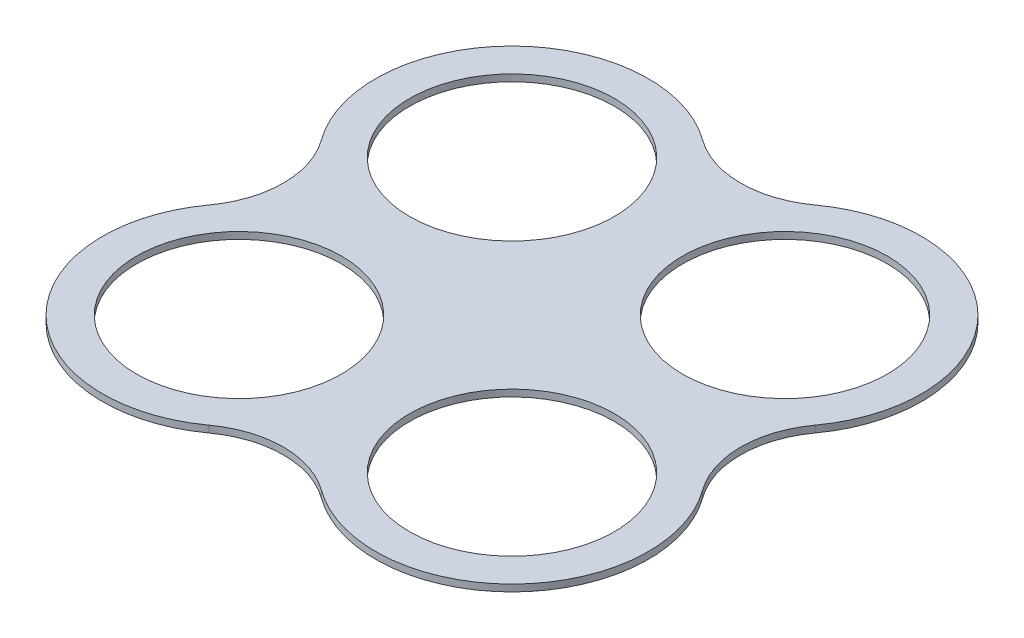
ISO-10303-21;
HEADER;
FILE_DESCRIPTION(('STEP AP214'),'2;1');
FILE_NAME('part.step','',(''),(''),'','','');
FILE_SCHEMA(('AUTOMOTIVE_DESIGN { 1 0 10303 214 1 1 1 1 }'));
ENDSEC;
DATA;
#1=APPLICATION_CONTEXT('core data for automotive mechanical design processes');
#2=APPLICATION_PROTOCOL_DEFINITION('international standard','automotive_design',2000,#1);
#3=PRODUCT_CONTEXT('',#1,'mechanical');
#4=PRODUCT('Part','Part','',(#3));
#5=PRODUCT_RELATED_PRODUCT_CATEGORY('part','',(#4));
#6=PRODUCT_DEFINITION_FORMATION('','',#4);
#7=PRODUCT_DEFINITION_CONTEXT('part definition',#1,'design');
#8=PRODUCT_DEFINITION('design','',#6,#7);
#9=PRODUCT_DEFINITION_SHAPE('','',#8);
#10=(LENGTH_UNIT() NAMED_UNIT(*) SI_UNIT(.MILLI.,.METRE.));
#11=(NAMED_UNIT(*) PLANE_ANGLE_UNIT() SI_UNIT($,.RADIAN.));
#12=(NAMED_UNIT(*) SI_UNIT($,.STERADIAN.) SOLID_ANGLE_UNIT());
#13=UNCERTAINTY_MEASURE_WITH_UNIT(LENGTH_MEASURE(1.E-05),#10,'distance_accuracy_value','');
#14=(GEOMETRIC_REPRESENTATION_CONTEXT(3) GLOBAL_UNCERTAINTY_ASSIGNED_CONTEXT((#13)) GLOBAL_UNIT_ASSIGNED_CONTEXT((#10,
#11,#12)) REPRESENTATION_CONTEXT('',''));
#15=CARTESIAN_POINT('',(0.,0.,0.));
#16=DIRECTION('',(0.,0.,1.));
#17=DIRECTION('',(1.,0.,0.));
#18=AXIS2_PLACEMENT_3D('',#15,#16,#17);
#19=CARTESIAN_POINT('',(190.5,6.35,-87.2980669889087));
#20=DIRECTION('',(0.,1.,0.));
#21=DIRECTION('',(0.,0.,1.));
#22=AXIS2_PLACEMENT_3D('',#19,#20,#21);
#23=PLANE('',#22);
#24=CARTESIAN_POINT('',(254.,6.35,254.));
#25=DIRECTION('',(0.,1.,0.));
#26=DIRECTION('',(0.,0.,1.));
#27=AXIS2_PLACEMENT_3D('',#24,#25,#26);
#28=CIRCLE('',#27,95.25);
#29=CARTESIAN_POINT('',(254.,6.35,349.25));
#30=VERTEX_POINT('',#29);
#31=EDGE_CURVE('E187',#30,#30,#28,.T.);
#32=ORIENTED_EDGE('',*,*,#31,.F.);
#33=EDGE_LOOP('',(#32));
#34=FACE_BOUND('',#33,.T.);
#35=CARTESIAN_POINT('',(0.,6.35,0.));
#36=DIRECTION('',(0.,1.,0.));
#37=DIRECTION('',(0.,0.,1.));
#38=AXIS2_PLACEMENT_3D('',#35,#36,#37);
#39=CIRCLE('',#38,95.25);
#40=CARTESIAN_POINT('',(0.,6.35,95.25));
#41=VERTEX_POINT('',#40);
#42=EDGE_CURVE('E133',#41,#41,#39,.T.);
#43=ORIENTED_EDGE('',*,*,#42,.F.);
#44=EDGE_LOOP('',(#43));
#45=FACE_BOUND('',#44,.T.);
#46=CARTESIAN_POINT('',(127.,6.35,-174.596133977817));
#47=DIRECTION('',(0.,-1.,0.));
#48=DIRECTION('',(0.,0.,1.));
#49=AXIS2_PLACEMENT_3D('',#46,#47,#48);
#50=CIRCLE('',#49,88.8999999999999);
#51=CARTESIAN_POINT('',(179.294117647059,6.35,-102.703608222245));
#52=VERTEX_POINT('',#51);
#53=CARTESIAN_POINT('',(74.7058823529412,6.35,-102.703608222246));
#54=VERTEX_POINT('',#53);
#55=EDGE_CURVE('E144',#52,#54,#50,.T.);
#56=ORIENTED_EDGE('',*,*,#55,.T.);
#57=CARTESIAN_POINT('',(0.,6.35,0.));
#58=DIRECTION('',(0.,1.,0.));
#59=DIRECTION('',(0.,0.,1.));
#60=AXIS2_PLACEMENT_3D('',#57,#58,#59);
#61=CIRCLE('',#60,127.);
#62=CARTESIAN_POINT('',(-102.703608222246,6.35,74.7058823529412));
#63=VERTEX_POINT('',#62);
#64=EDGE_CURVE('E92',#54,#63,#61,.T.);
#65=ORIENTED_EDGE('',*,*,#64,.T.);
#66=CARTESIAN_POINT('',(-174.596133977818,6.35,127.));
#67=DIRECTION('',(0.,-1.,0.));
#68=DIRECTION('',(0.,0.,1.));
#69=AXIS2_PLACEMENT_3D('',#66,#67,#68);
#70=CIRCLE('',#69,88.9);
#71=CARTESIAN_POINT('',(-102.703608222246,6.35,179.294117647059));
#72=VERTEX_POINT('',#71);
#73=EDGE_CURVE('E159',#63,#72,#70,.T.);
#74=ORIENTED_EDGE('',*,*,#73,.T.);
#75=CARTESIAN_POINT('',(0.,6.35,254.));
#76=DIRECTION('',(0.,1.,0.));
#77=DIRECTION('',(0.,0.,1.));
#78=AXIS2_PLACEMENT_3D('',#75,#76,#77);
#79=CIRCLE('',#78,127.);
#80=CARTESIAN_POINT('',(74.7058823529411,6.35,356.703608222246));
#81=VERTEX_POINT('',#80);
#82=EDGE_CURVE('E172',#72,#81,#79,.T.);
#83=ORIENTED_EDGE('',*,*,#82,.T.);
#84=CARTESIAN_POINT('',(127.,6.35,428.596133977818));
#85=DIRECTION('',(0.,-1.,0.));
#86=DIRECTION('',(0.,0.,1.));
#87=AXIS2_PLACEMENT_3D('',#84,#85,#86);
#88=CIRCLE('',#87,88.9000000000001);
#89=CARTESIAN_POINT('',(179.294117647059,6.35,356.703608222246));
#90=VERTEX_POINT('',#89);
#91=EDGE_CURVE('E111',#81,#90,#88,.T.);
#92=ORIENTED_EDGE('',*,*,#91,.T.);
#93=CARTESIAN_POINT('',(254.,6.35,254.));
#94=DIRECTION('',(0.,1.,0.));
#95=DIRECTION('',(0.,0.,1.));
#96=AXIS2_PLACEMENT_3D('',#93,#94,#95);
#97=CIRCLE('',#96,127.);
#98=CARTESIAN_POINT('',(356.703608222246,6.35,179.294117647059));
#99=VERTEX_POINT('',#98);
#100=EDGE_CURVE('E105',#90,#99,#97,.T.);
#101=ORIENTED_EDGE('',*,*,#100,.T.);
#102=CARTESIAN_POINT('',(428.596133977817,6.35,127.));
#103=DIRECTION('',(0.,-1.,0.));
#104=DIRECTION('',(0.,0.,1.));
#105=AXIS2_PLACEMENT_3D('',#102,#103,#104);
#106=CIRCLE('',#105,88.8999999999999);
#107=CARTESIAN_POINT('',(356.703608222246,6.35,74.7058823529412));
#108=VERTEX_POINT('',#107);
#109=EDGE_CURVE('E109',#99,#108,#106,.T.);
#110=ORIENTED_EDGE('',*,*,#109,.T.);
#111=CARTESIAN_POINT('',(254.,6.35,0.));
#112=DIRECTION('',(0.,1.,0.));
#113=DIRECTION('',(0.,0.,1.));
#114=AXIS2_PLACEMENT_3D('',#111,#112,#113);
#115=CIRCLE('',#114,127.);
#116=EDGE_CURVE('E49',#108,#52,#115,.T.);
#117=ORIENTED_EDGE('',*,*,#116,.T.);
#118=EDGE_LOOP('',(#56,#65,#74,#83,#92,#101,#110,#117));
#119=FACE_BOUND('',#118,.T.);
#120=CARTESIAN_POINT('',(254.,6.35,0.));
#121=DIRECTION('',(0.,1.,0.));
#122=DIRECTION('',(0.,0.,1.));
#123=AXIS2_PLACEMENT_3D('',#120,#121,#122);
#124=CIRCLE('',#123,95.25);
#125=CARTESIAN_POINT('',(254.,6.35,95.2500000000001));
#126=VERTEX_POINT('',#125);
#127=EDGE_CURVE('E181',#126,#126,#124,.T.);
#128=ORIENTED_EDGE('',*,*,#127,.F.);
#129=EDGE_LOOP('',(#128));
#130=FACE_BOUND('',#129,.T.);
#131=CARTESIAN_POINT('',(0.,6.35,254.));
#132=DIRECTION('',(0.,1.,0.));
#133=DIRECTION('',(0.,0.,1.));
#134=AXIS2_PLACEMENT_3D('',#131,#132,#133);
#135=CIRCLE('',#134,95.25);
#136=CARTESIAN_POINT('',(0.,6.35,349.25));
#137=VERTEX_POINT('',#136);
#138=EDGE_CURVE('E193',#137,#137,#135,.T.);
#139=ORIENTED_EDGE('',*,*,#138,.F.);
#140=EDGE_LOOP('',(#139));
#141=FACE_BOUND('',#140,.T.);
#142=ADVANCED_FACE('F32',(#34,#45,#119,#130,#141),#23,.T.);
#143=CARTESIAN_POINT('',(190.5,0.,-87.2980669889087));
#144=DIRECTION('',(0.,1.,0.));
#145=DIRECTION('',(0.,0.,1.));
#146=AXIS2_PLACEMENT_3D('',#143,#144,#145);
#147=PLANE('',#146);
#148=CARTESIAN_POINT('',(127.,0.,-174.596133977817));
#149=DIRECTION('',(0.,-1.,0.));
#150=DIRECTION('',(0.,0.,1.));
#151=AXIS2_PLACEMENT_3D('',#148,#149,#150);
#152=CIRCLE('',#151,88.8999999999999);
#153=CARTESIAN_POINT('',(179.294117647059,0.,-102.703608222245));
#154=VERTEX_POINT('',#153);
#155=CARTESIAN_POINT('',(74.7058823529412,0.,-102.703608222246));
#156=VERTEX_POINT('',#155);
#157=EDGE_CURVE('E129',#154,#156,#152,.T.);
#158=ORIENTED_EDGE('',*,*,#157,.F.);
#159=CARTESIAN_POINT('',(254.,0.,0.));
#160=DIRECTION('',(0.,1.,0.));
#161=DIRECTION('',(0.,0.,1.));
#162=AXIS2_PLACEMENT_3D('',#159,#160,#161);
#163=CIRCLE('',#162,127.);
#164=CARTESIAN_POINT('',(356.703608222246,0.,74.7058823529412));
#165=VERTEX_POINT('',#164);
#166=EDGE_CURVE('E84',#165,#154,#163,.T.);
#167=ORIENTED_EDGE('',*,*,#166,.F.);
#168=CARTESIAN_POINT('',(428.596133977817,0.,127.));
#169=DIRECTION('',(0.,-1.,0.));
#170=DIRECTION('',(0.,0.,1.));
#171=AXIS2_PLACEMENT_3D('',#168,#169,#170);
#172=CIRCLE('',#171,88.8999999999999);
#173=CARTESIAN_POINT('',(356.703608222246,0.,179.294117647059));
#174=VERTEX_POINT('',#173);
#175=EDGE_CURVE('E78',#174,#165,#172,.T.);
#176=ORIENTED_EDGE('',*,*,#175,.F.);
#177=CARTESIAN_POINT('',(254.,0.,254.));
#178=DIRECTION('',(0.,1.,0.));
#179=DIRECTION('',(0.,0.,1.));
#180=AXIS2_PLACEMENT_3D('',#177,#178,#179);
#181=CIRCLE('',#180,127.);
#182=CARTESIAN_POINT('',(179.294117647059,0.,356.703608222246));
#183=VERTEX_POINT('',#182);
#184=EDGE_CURVE('E119',#183,#174,#181,.T.);
#185=ORIENTED_EDGE('',*,*,#184,.F.);
#186=CARTESIAN_POINT('',(127.,0.,428.596133977818));
#187=DIRECTION('',(0.,-1.,0.));
#188=DIRECTION('',(0.,0.,1.));
#189=AXIS2_PLACEMENT_3D('',#186,#187,#188);
#190=CIRCLE('',#189,88.9000000000001);
#191=CARTESIAN_POINT('',(74.7058823529411,0.,356.703608222246));
#192=VERTEX_POINT('',#191);
#193=EDGE_CURVE('E139',#192,#183,#190,.T.);
#194=ORIENTED_EDGE('',*,*,#193,.F.);
#195=CARTESIAN_POINT('',(0.,0.,254.));
#196=DIRECTION('',(0.,1.,0.));
#197=DIRECTION('',(0.,0.,1.));
#198=AXIS2_PLACEMENT_3D('',#195,#196,#197);
#199=CIRCLE('',#198,127.);
#200=CARTESIAN_POINT('',(-102.703608222246,0.,179.294117647059));
#201=VERTEX_POINT('',#200);
#202=EDGE_CURVE('E137',#201,#192,#199,.T.);
#203=ORIENTED_EDGE('',*,*,#202,.F.);
#204=CARTESIAN_POINT('',(-174.596133977818,0.,127.));
#205=DIRECTION('',(0.,-1.,0.));
#206=DIRECTION('',(0.,0.,1.));
#207=AXIS2_PLACEMENT_3D('',#204,#205,#206);
#208=CIRCLE('',#207,88.9);
#209=CARTESIAN_POINT('',(-102.703608222246,0.,74.7058823529412));
#210=VERTEX_POINT('',#209);
#211=EDGE_CURVE('E135',#210,#201,#208,.T.);
#212=ORIENTED_EDGE('',*,*,#211,.F.);
#213=CARTESIAN_POINT('',(0.,0.,0.));
#214=DIRECTION('',(0.,1.,0.));
#215=DIRECTION('',(0.,0.,1.));
#216=AXIS2_PLACEMENT_3D('',#213,#214,#215);
#217=CIRCLE('',#216,127.);
#218=EDGE_CURVE('E132',#156,#210,#217,.T.);
#219=ORIENTED_EDGE('',*,*,#218,.F.);
#220=EDGE_LOOP('',(#158,#167,#176,#185,#194,#203,#212,#219));
#221=FACE_BOUND('',#220,.T.);
#222=CARTESIAN_POINT('',(0.,0.,0.));
#223=DIRECTION('',(0.,1.,0.));
#224=DIRECTION('',(0.,0.,1.));
#225=AXIS2_PLACEMENT_3D('',#222,#223,#224);
#226=CIRCLE('',#225,95.25);
#227=CARTESIAN_POINT('',(0.,0.,95.25));
#228=VERTEX_POINT('',#227);
#229=EDGE_CURVE('E178',#228,#228,#226,.T.);
#230=ORIENTED_EDGE('',*,*,#229,.T.);
#231=EDGE_LOOP('',(#230));
#232=FACE_BOUND('',#231,.T.);
#233=CARTESIAN_POINT('',(254.,0.,0.));
#234=DIRECTION('',(0.,1.,0.));
#235=DIRECTION('',(0.,0.,1.));
#236=AXIS2_PLACEMENT_3D('',#233,#234,#235);
#237=CIRCLE('',#236,95.25);
#238=CARTESIAN_POINT('',(254.,0.,95.2500000000001));
#239=VERTEX_POINT('',#238);
#240=EDGE_CURVE('E184',#239,#239,#237,.T.);
#241=ORIENTED_EDGE('',*,*,#240,.T.);
#242=EDGE_LOOP('',(#241));
#243=FACE_BOUND('',#242,.T.);
#244=CARTESIAN_POINT('',(254.,0.,254.));
#245=DIRECTION('',(0.,1.,0.));
#246=DIRECTION('',(0.,0.,1.));
#247=AXIS2_PLACEMENT_3D('',#244,#245,#246);
#248=CIRCLE('',#247,95.25);
#249=CARTESIAN_POINT('',(254.,0.,349.25));
#250=VERTEX_POINT('',#249);
#251=EDGE_CURVE('E190',#250,#250,#248,.T.);
#252=ORIENTED_EDGE('',*,*,#251,.T.);
#253=EDGE_LOOP('',(#252));
#254=FACE_BOUND('',#253,.T.);
#255=CARTESIAN_POINT('',(0.,0.,254.));
#256=DIRECTION('',(0.,1.,0.));
#257=DIRECTION('',(0.,0.,1.));
#258=AXIS2_PLACEMENT_3D('',#255,#256,#257);
#259=CIRCLE('',#258,95.25);
#260=CARTESIAN_POINT('',(0.,0.,349.25));
#261=VERTEX_POINT('',#260);
#262=EDGE_CURVE('E196',#261,#261,#259,.T.);
#263=ORIENTED_EDGE('',*,*,#262,.T.);
#264=EDGE_LOOP('',(#263));
#265=FACE_BOUND('',#264,.T.);
#266=ADVANCED_FACE('F163',(#221,#232,#243,#254,#265),#147,.F.);
#267=CARTESIAN_POINT('',(127.,6.35,-174.596133977817));
#268=DIRECTION('',(0.,-1.,0.));
#269=DIRECTION('',(0.,0.,-1.));
#270=AXIS2_PLACEMENT_3D('',#267,#268,#269);
#271=CYLINDRICAL_SURFACE('',#270,88.8999999999999);
#272=ORIENTED_EDGE('',*,*,#157,.T.);
#273=DIRECTION('',(0.,-1.,0.));
#274=VECTOR('',#273,1.);
#275=CARTESIAN_POINT('',(74.7058823529412,6.35,-102.703608222246));
#276=LINE('',#275,#274);
#277=EDGE_CURVE('E11',#54,#156,#276,.T.);
#278=ORIENTED_EDGE('',*,*,#277,.F.);
#279=ORIENTED_EDGE('',*,*,#55,.F.);
#280=DIRECTION('',(0.,-1.,0.));
#281=VECTOR('',#280,1.);
#282=CARTESIAN_POINT('',(179.294117647059,6.35,-102.703608222245));
#283=LINE('',#282,#281);
#284=EDGE_CURVE('E125',#52,#154,#283,.T.);
#285=ORIENTED_EDGE('',*,*,#284,.T.);
#286=EDGE_LOOP('',(#272,#278,#279,#285));
#287=FACE_BOUND('',#286,.T.);
#288=ADVANCED_FACE('F34',(#287),#271,.F.);
#289=CARTESIAN_POINT('',(0.,6.35,0.));
#290=DIRECTION('',(0.,-1.,0.));
#291=DIRECTION('',(0.,0.,-1.));
#292=AXIS2_PLACEMENT_3D('',#289,#290,#291);
#293=CYLINDRICAL_SURFACE('',#292,127.);
#294=ORIENTED_EDGE('',*,*,#218,.T.);
#295=DIRECTION('',(0.,-1.,0.));
#296=VECTOR('',#295,1.);
#297=CARTESIAN_POINT('',(-102.703608222246,6.35,74.7058823529412));
#298=LINE('',#297,#296);
#299=EDGE_CURVE('E41',#63,#210,#298,.T.);
#300=ORIENTED_EDGE('',*,*,#299,.F.);
#301=ORIENTED_EDGE('',*,*,#64,.F.);
#302=ORIENTED_EDGE('',*,*,#277,.T.);
#303=EDGE_LOOP('',(#294,#300,#301,#302));
#304=FACE_BOUND('',#303,.T.);
#305=ADVANCED_FACE('F230',(#304),#293,.T.);
#306=CARTESIAN_POINT('',(-174.596133977818,6.35,127.));
#307=DIRECTION('',(0.,-1.,0.));
#308=DIRECTION('',(0.,0.,-1.));
#309=AXIS2_PLACEMENT_3D('',#306,#307,#308);
#310=CYLINDRICAL_SURFACE('',#309,88.9);
#311=ORIENTED_EDGE('',*,*,#211,.T.);
#312=DIRECTION('',(0.,-1.,0.));
#313=VECTOR('',#312,1.);
#314=CARTESIAN_POINT('',(-102.703608222246,6.35,179.294117647059));
#315=LINE('',#314,#313);
#316=EDGE_CURVE('E151',#72,#201,#315,.T.);
#317=ORIENTED_EDGE('',*,*,#316,.F.);
#318=ORIENTED_EDGE('',*,*,#73,.F.);
#319=ORIENTED_EDGE('',*,*,#299,.T.);
#320=EDGE_LOOP('',(#311,#317,#318,#319));
#321=FACE_BOUND('',#320,.T.);
#322=ADVANCED_FACE('F157',(#321),#310,.F.);
#323=CARTESIAN_POINT('',(0.,6.35,254.));
#324=DIRECTION('',(0.,-1.,0.));
#325=DIRECTION('',(0.,0.,-1.));
#326=AXIS2_PLACEMENT_3D('',#323,#324,#325);
#327=CYLINDRICAL_SURFACE('',#326,127.);
#328=ORIENTED_EDGE('',*,*,#202,.T.);
#329=DIRECTION('',(0.,-1.,0.));
#330=VECTOR('',#329,1.);
#331=CARTESIAN_POINT('',(74.7058823529411,6.35,356.703608222246));
#332=LINE('',#331,#330);
#333=EDGE_CURVE('E148',#81,#192,#332,.T.);
#334=ORIENTED_EDGE('',*,*,#333,.F.);
#335=ORIENTED_EDGE('',*,*,#82,.F.);
#336=ORIENTED_EDGE('',*,*,#316,.T.);
#337=EDGE_LOOP('',(#328,#334,#335,#336));
#338=FACE_BOUND('',#337,.T.);
#339=ADVANCED_FACE('F168',(#338),#327,.T.);
#340=CARTESIAN_POINT('',(127.,6.35,428.596133977818));
#341=DIRECTION('',(0.,-1.,0.));
#342=DIRECTION('',(0.,0.,-1.));
#343=AXIS2_PLACEMENT_3D('',#340,#341,#342);
#344=CYLINDRICAL_SURFACE('',#343,88.9000000000001);
#345=ORIENTED_EDGE('',*,*,#193,.T.);
#346=DIRECTION('',(0.,-1.,0.));
#347=VECTOR('',#346,1.);
#348=CARTESIAN_POINT('',(179.294117647059,6.35,356.703608222246));
#349=LINE('',#348,#347);
#350=EDGE_CURVE('E120',#90,#183,#349,.T.);
#351=ORIENTED_EDGE('',*,*,#350,.F.);
#352=ORIENTED_EDGE('',*,*,#91,.F.);
#353=ORIENTED_EDGE('',*,*,#333,.T.);
#354=EDGE_LOOP('',(#345,#351,#352,#353));
#355=FACE_BOUND('',#354,.T.);
#356=ADVANCED_FACE('F171',(#355),#344,.F.);
#357=CARTESIAN_POINT('',(254.,6.35,254.));
#358=DIRECTION('',(0.,-1.,0.));
#359=DIRECTION('',(0.,0.,-1.));
#360=AXIS2_PLACEMENT_3D('',#357,#358,#359);
#361=CYLINDRICAL_SURFACE('',#360,127.);
#362=ORIENTED_EDGE('',*,*,#184,.T.);
#363=DIRECTION('',(0.,-1.,0.));
#364=VECTOR('',#363,1.);
#365=CARTESIAN_POINT('',(356.703608222246,6.35,179.294117647059));
#366=LINE('',#365,#364);
#367=EDGE_CURVE('E116',#99,#174,#366,.T.);
#368=ORIENTED_EDGE('',*,*,#367,.F.);
#369=ORIENTED_EDGE('',*,*,#100,.F.);
#370=ORIENTED_EDGE('',*,*,#350,.T.);
#371=EDGE_LOOP('',(#362,#368,#369,#370));
#372=FACE_BOUND('',#371,.T.);
#373=ADVANCED_FACE('F117',(#372),#361,.T.);
#374=CARTESIAN_POINT('',(428.596133977817,6.35,127.));
#375=DIRECTION('',(0.,-1.,0.));
#376=DIRECTION('',(0.,0.,-1.));
#377=AXIS2_PLACEMENT_3D('',#374,#375,#376);
#378=CYLINDRICAL_SURFACE('',#377,88.8999999999999);
#379=ORIENTED_EDGE('',*,*,#175,.T.);
#380=DIRECTION('',(0.,-1.,0.));
#381=VECTOR('',#380,1.);
#382=CARTESIAN_POINT('',(356.703608222246,6.35,74.7058823529412));
#383=LINE('',#382,#381);
#384=EDGE_CURVE('E121',#108,#165,#383,.T.);
#385=ORIENTED_EDGE('',*,*,#384,.F.);
#386=ORIENTED_EDGE('',*,*,#109,.F.);
#387=ORIENTED_EDGE('',*,*,#367,.T.);
#388=EDGE_LOOP('',(#379,#385,#386,#387));
#389=FACE_BOUND('',#388,.T.);
#390=ADVANCED_FACE('F123',(#389),#378,.F.);
#391=CARTESIAN_POINT('',(254.,6.35,0.));
#392=DIRECTION('',(0.,-1.,0.));
#393=DIRECTION('',(0.,0.,-1.));
#394=AXIS2_PLACEMENT_3D('',#391,#392,#393);
#395=CYLINDRICAL_SURFACE('',#394,127.);
#396=ORIENTED_EDGE('',*,*,#166,.T.);
#397=ORIENTED_EDGE('',*,*,#284,.F.);
#398=ORIENTED_EDGE('',*,*,#116,.F.);
#399=ORIENTED_EDGE('',*,*,#384,.T.);
#400=EDGE_LOOP('',(#396,#397,#398,#399));
#401=FACE_BOUND('',#400,.T.);
#402=ADVANCED_FACE('F218',(#401),#395,.T.);
#403=CARTESIAN_POINT('',(0.,6.35,0.));
#404=DIRECTION('',(0.,-1.,0.));
#405=DIRECTION('',(0.,0.,-1.));
#406=AXIS2_PLACEMENT_3D('',#403,#404,#405);
#407=CYLINDRICAL_SURFACE('',#406,95.25);
#408=ORIENTED_EDGE('',*,*,#42,.T.);
#409=EDGE_LOOP('',(#408));
#410=FACE_BOUND('',#409,.T.);
#411=ORIENTED_EDGE('',*,*,#229,.F.);
#412=EDGE_LOOP('',(#411));
#413=FACE_BOUND('',#412,.T.);
#414=ADVANCED_FACE('F215',(#410,#413),#407,.F.);
#415=CARTESIAN_POINT('',(254.,6.35,0.));
#416=DIRECTION('',(0.,-1.,0.));
#417=DIRECTION('',(0.,0.,-1.));
#418=AXIS2_PLACEMENT_3D('',#415,#416,#417);
#419=CYLINDRICAL_SURFACE('',#418,95.25);
#420=ORIENTED_EDGE('',*,*,#127,.T.);
#421=EDGE_LOOP('',(#420));
#422=FACE_BOUND('',#421,.T.);
#423=ORIENTED_EDGE('',*,*,#240,.F.);
#424=EDGE_LOOP('',(#423));
#425=FACE_BOUND('',#424,.T.);
#426=ADVANCED_FACE('F294',(#422,#425),#419,.F.);
#427=CARTESIAN_POINT('',(254.,6.35,254.));
#428=DIRECTION('',(0.,-1.,0.));
#429=DIRECTION('',(0.,0.,-1.));
#430=AXIS2_PLACEMENT_3D('',#427,#428,#429);
#431=CYLINDRICAL_SURFACE('',#430,95.25);
#432=ORIENTED_EDGE('',*,*,#31,.T.);
#433=EDGE_LOOP('',(#432));
#434=FACE_BOUND('',#433,.T.);
#435=ORIENTED_EDGE('',*,*,#251,.F.);
#436=EDGE_LOOP('',(#435));
#437=FACE_BOUND('',#436,.T.);
#438=ADVANCED_FACE('F302',(#434,#437),#431,.F.);
#439=CARTESIAN_POINT('',(0.,6.35,254.));
#440=DIRECTION('',(0.,-1.,0.));
#441=DIRECTION('',(0.,0.,-1.));
#442=AXIS2_PLACEMENT_3D('',#439,#440,#441);
#443=CYLINDRICAL_SURFACE('',#442,95.25);
#444=ORIENTED_EDGE('',*,*,#138,.T.);
#445=EDGE_LOOP('',(#444));
#446=FACE_BOUND('',#445,.T.);
#447=ORIENTED_EDGE('',*,*,#262,.F.);
#448=EDGE_LOOP('',(#447));
#449=FACE_BOUND('',#448,.T.);
#450=ADVANCED_FACE('F202',(#446,#449),#443,.F.);
#451=CLOSED_SHELL('',(#142,#266,#288,#305,#322,#339,#356,#373,#390,#402,#414,#426,#438,#450));
#452=MANIFOLD_SOLID_BREP('B2',#451);
#453=ADVANCED_BREP_SHAPE_REPRESENTATION('',(#18,#452),#14);
#454=SHAPE_DEFINITION_REPRESENTATION(#9,#453);
ENDSEC;
END-ISO-10303-21;
